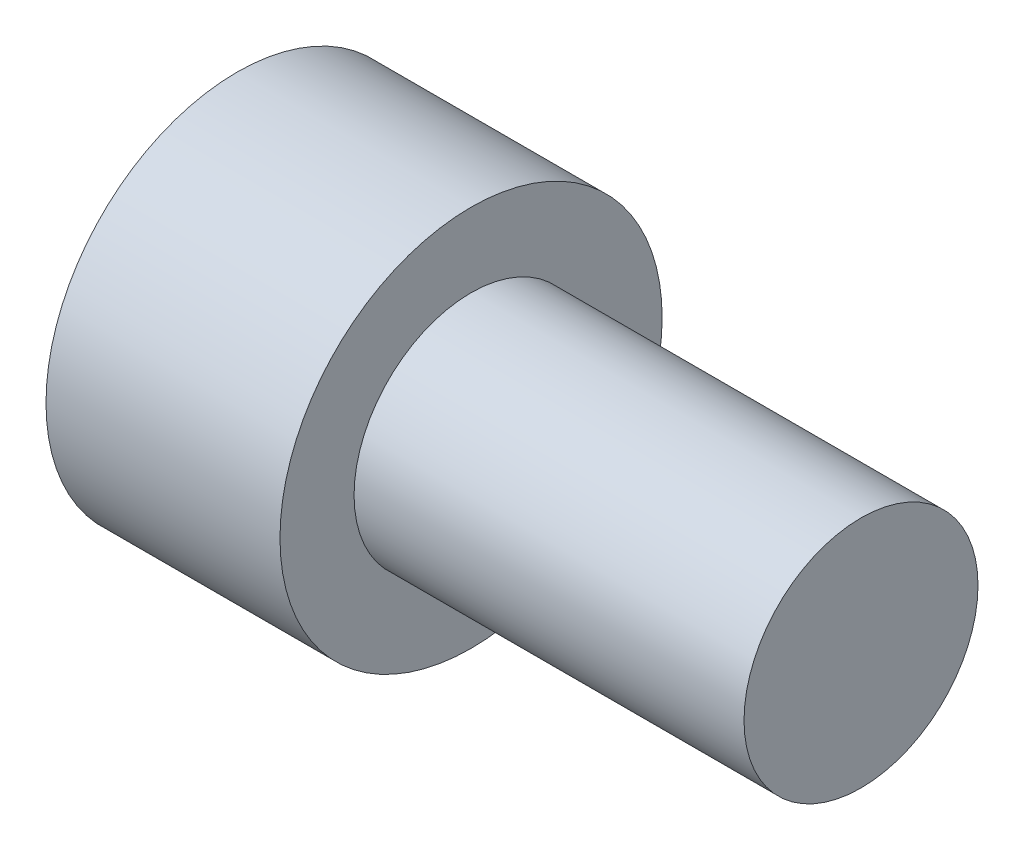
ISO-10303-21;
HEADER;
FILE_DESCRIPTION(('STEP AP214'),'2;1');
FILE_NAME('part.step','',(''),(''),'','','');
FILE_SCHEMA(('AUTOMOTIVE_DESIGN { 1 0 10303 214 1 1 1 1 }'));
ENDSEC;
DATA;
#1=APPLICATION_CONTEXT('core data for automotive mechanical design processes');
#2=APPLICATION_PROTOCOL_DEFINITION('international standard','automotive_design',2000,#1);
#3=PRODUCT_CONTEXT('',#1,'mechanical');
#4=PRODUCT('Part','Part','',(#3));
#5=PRODUCT_RELATED_PRODUCT_CATEGORY('part','',(#4));
#6=PRODUCT_DEFINITION_FORMATION('','',#4);
#7=PRODUCT_DEFINITION_CONTEXT('part definition',#1,'design');
#8=PRODUCT_DEFINITION('design','',#6,#7);
#9=PRODUCT_DEFINITION_SHAPE('','',#8);
#10=(LENGTH_UNIT() NAMED_UNIT(*) SI_UNIT(.MILLI.,.METRE.));
#11=(NAMED_UNIT(*) PLANE_ANGLE_UNIT() SI_UNIT($,.RADIAN.));
#12=(NAMED_UNIT(*) SI_UNIT($,.STERADIAN.) SOLID_ANGLE_UNIT());
#13=UNCERTAINTY_MEASURE_WITH_UNIT(LENGTH_MEASURE(1.E-05),#10,'distance_accuracy_value','');
#14=(GEOMETRIC_REPRESENTATION_CONTEXT(3) GLOBAL_UNCERTAINTY_ASSIGNED_CONTEXT((#13)) GLOBAL_UNIT_ASSIGNED_CONTEXT((#10,
#11,#12)) REPRESENTATION_CONTEXT('',''));
#15=CARTESIAN_POINT('',(0.,0.,0.));
#16=DIRECTION('',(0.,0.,1.));
#17=DIRECTION('',(1.,0.,0.));
#18=AXIS2_PLACEMENT_3D('',#15,#16,#17);
#19=CARTESIAN_POINT('',(19.05,0.,0.));
#20=DIRECTION('',(1.,0.,0.));
#21=DIRECTION('',(0.,0.,-1.));
#22=AXIS2_PLACEMENT_3D('',#19,#20,#21);
#23=PLANE('',#22);
#24=CARTESIAN_POINT('',(19.05,0.,0.));
#25=DIRECTION('',(-1.,0.,0.));
#26=DIRECTION('',(0.,0.,1.));
#27=AXIS2_PLACEMENT_3D('',#24,#25,#26);
#28=CIRCLE('',#27,15.5575);
#29=CARTESIAN_POINT('',(19.05,0.,15.5575));
#30=VERTEX_POINT('',#29);
#31=EDGE_CURVE('E41',#30,#30,#28,.T.);
#32=ORIENTED_EDGE('',*,*,#31,.F.);
#33=EDGE_LOOP('',(#32));
#34=FACE_BOUND('',#33,.T.);
#35=CARTESIAN_POINT('',(19.05,0.,0.));
#36=DIRECTION('',(1.,0.,0.));
#37=DIRECTION('',(0.,0.,-1.));
#38=AXIS2_PLACEMENT_3D('',#35,#36,#37);
#39=CIRCLE('',#38,9.525);
#40=CARTESIAN_POINT('',(19.05,0.,-9.525));
#41=VERTEX_POINT('',#40);
#42=EDGE_CURVE('E49',#41,#41,#39,.T.);
#43=ORIENTED_EDGE('',*,*,#42,.F.);
#44=EDGE_LOOP('',(#43));
#45=FACE_BOUND('',#44,.T.);
#46=ADVANCED_FACE('F34',(#34,#45),#23,.T.);
#47=CARTESIAN_POINT('',(0.,0.,0.));
#48=DIRECTION('',(-1.,0.,0.));
#49=DIRECTION('',(0.,0.,1.));
#50=AXIS2_PLACEMENT_3D('',#47,#48,#49);
#51=CYLINDRICAL_SURFACE('',#50,15.5575);
#52=ORIENTED_EDGE('',*,*,#31,.T.);
#53=EDGE_LOOP('',(#52));
#54=FACE_BOUND('',#53,.T.);
#55=CARTESIAN_POINT('',(0.,0.,0.));
#56=DIRECTION('',(-1.,0.,0.));
#57=DIRECTION('',(0.,0.,1.));
#58=AXIS2_PLACEMENT_3D('',#55,#56,#57);
#59=CIRCLE('',#58,15.5575);
#60=CARTESIAN_POINT('',(0.,0.,15.5575));
#61=VERTEX_POINT('',#60);
#62=EDGE_CURVE('E10',#61,#61,#59,.T.);
#63=ORIENTED_EDGE('',*,*,#62,.F.);
#64=EDGE_LOOP('',(#63));
#65=FACE_BOUND('',#64,.T.);
#66=ADVANCED_FACE('F36',(#54,#65),#51,.T.);
#67=CARTESIAN_POINT('',(0.,0.,0.));
#68=DIRECTION('',(-1.,0.,0.));
#69=DIRECTION('',(0.,0.,1.));
#70=AXIS2_PLACEMENT_3D('',#67,#68,#69);
#71=PLANE('',#70);
#72=ORIENTED_EDGE('',*,*,#62,.T.);
#73=EDGE_LOOP('',(#72));
#74=FACE_BOUND('',#73,.T.);
#75=ADVANCED_FACE('F63',(#74),#71,.T.);
#76=CARTESIAN_POINT('',(50.8,0.,0.));
#77=DIRECTION('',(-1.,0.,0.));
#78=DIRECTION('',(0.,0.,1.));
#79=AXIS2_PLACEMENT_3D('',#76,#77,#78);
#80=CYLINDRICAL_SURFACE('',#79,9.525);
#81=CARTESIAN_POINT('',(50.8,0.,0.));
#82=DIRECTION('',(1.,0.,0.));
#83=DIRECTION('',(0.,0.,-1.));
#84=AXIS2_PLACEMENT_3D('',#81,#82,#83);
#85=CIRCLE('',#84,9.525);
#86=CARTESIAN_POINT('',(50.8,0.,-9.525));
#87=VERTEX_POINT('',#86);
#88=EDGE_CURVE('E45',#87,#87,#85,.T.);
#89=ORIENTED_EDGE('',*,*,#88,.F.);
#90=EDGE_LOOP('',(#89));
#91=FACE_BOUND('',#90,.T.);
#92=ORIENTED_EDGE('',*,*,#42,.T.);
#93=EDGE_LOOP('',(#92));
#94=FACE_BOUND('',#93,.T.);
#95=ADVANCED_FACE('F55',(#91,#94),#80,.T.);
#96=CARTESIAN_POINT('',(50.8,0.,0.));
#97=DIRECTION('',(1.,0.,0.));
#98=DIRECTION('',(0.,0.,-1.));
#99=AXIS2_PLACEMENT_3D('',#96,#97,#98);
#100=PLANE('',#99);
#101=ORIENTED_EDGE('',*,*,#88,.T.);
#102=EDGE_LOOP('',(#101));
#103=FACE_BOUND('',#102,.T.);
#104=ADVANCED_FACE('F70',(#103),#100,.T.);
#105=CLOSED_SHELL('',(#46,#66,#75,#95,#104));
#106=MANIFOLD_SOLID_BREP('B2',#105);
#107=ADVANCED_BREP_SHAPE_REPRESENTATION('',(#18,#106),#14);
#108=SHAPE_DEFINITION_REPRESENTATION(#9,#107);
ENDSEC;
END-ISO-10303-21;
